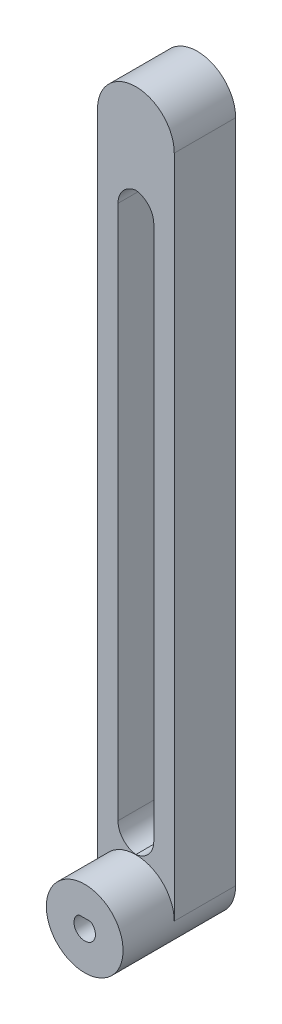
ISO-10303-21;
HEADER;
FILE_DESCRIPTION(('STEP AP214'),'2;1');
FILE_NAME('part.step','',(''),(''),'','','');
FILE_SCHEMA(('AUTOMOTIVE_DESIGN { 1 0 10303 214 1 1 1 1 }'));
ENDSEC;
DATA;
#1=APPLICATION_CONTEXT('core data for automotive mechanical design processes');
#2=APPLICATION_PROTOCOL_DEFINITION('international standard','automotive_design',2000,#1);
#3=PRODUCT_CONTEXT('',#1,'mechanical');
#4=PRODUCT('Part','Part','',(#3));
#5=PRODUCT_RELATED_PRODUCT_CATEGORY('part','',(#4));
#6=PRODUCT_DEFINITION_FORMATION('','',#4);
#7=PRODUCT_DEFINITION_CONTEXT('part definition',#1,'design');
#8=PRODUCT_DEFINITION('design','',#6,#7);
#9=PRODUCT_DEFINITION_SHAPE('','',#8);
#10=(LENGTH_UNIT() NAMED_UNIT(*) SI_UNIT(.MILLI.,.METRE.));
#11=(NAMED_UNIT(*) PLANE_ANGLE_UNIT() SI_UNIT($,.RADIAN.));
#12=(NAMED_UNIT(*) SI_UNIT($,.STERADIAN.) SOLID_ANGLE_UNIT());
#13=UNCERTAINTY_MEASURE_WITH_UNIT(LENGTH_MEASURE(1.E-05),#10,'distance_accuracy_value','');
#14=(GEOMETRIC_REPRESENTATION_CONTEXT(3) GLOBAL_UNCERTAINTY_ASSIGNED_CONTEXT((#13)) GLOBAL_UNIT_ASSIGNED_CONTEXT((#10,
#11,#12)) REPRESENTATION_CONTEXT('',''));
#15=CARTESIAN_POINT('',(0.,0.,0.));
#16=DIRECTION('',(0.,0.,1.));
#17=DIRECTION('',(1.,0.,0.));
#18=AXIS2_PLACEMENT_3D('',#15,#16,#17);
#19=CARTESIAN_POINT('',(1.85483870967741,102.58064516129,12.));
#20=DIRECTION('',(0.,0.,-1.));
#21=DIRECTION('',(-1.,0.,0.));
#22=AXIS2_PLACEMENT_3D('',#19,#20,#21);
#23=PLANE('',#22);
#24=DIRECTION('',(0.,1.,0.));
#25=VECTOR('',#24,1.);
#26=CARTESIAN_POINT('',(5.35483870967741,92.5806451612903,12.));
#27=LINE('',#26,#25);
#28=CARTESIAN_POINT('',(5.35483870967741,-15.9193548387097,12.));
#29=VERTEX_POINT('',#28);
#30=CARTESIAN_POINT('',(5.35483870967741,88.5806451612903,12.));
#31=VERTEX_POINT('',#30);
#32=EDGE_CURVE('E184',#29,#31,#27,.T.);
#33=ORIENTED_EDGE('',*,*,#32,.F.);
#34=CARTESIAN_POINT('',(1.35483870967741,-15.9193548387097,12.));
#35=DIRECTION('',(0.,0.,-1.));
#36=DIRECTION('',(-1.,0.,0.));
#37=AXIS2_PLACEMENT_3D('',#34,#35,#36);
#38=CIRCLE('',#37,4.);
#39=CARTESIAN_POINT('',(1.85483870967744,-19.8879818053066,12.));
#40=VERTEX_POINT('',#39);
#41=EDGE_CURVE('E302',#29,#40,#38,.T.);
#42=ORIENTED_EDGE('',*,*,#41,.T.);
#43=CARTESIAN_POINT('',(2.35483870967741,-15.9193548387097,12.));
#44=DIRECTION('',(0.,0.,-1.));
#45=DIRECTION('',(-1.,0.,0.));
#46=AXIS2_PLACEMENT_3D('',#43,#44,#45);
#47=CIRCLE('',#46,4.);
#48=CARTESIAN_POINT('',(-1.64516129032259,-15.9193548387097,12.));
#49=VERTEX_POINT('',#48);
#50=EDGE_CURVE('E296',#40,#49,#47,.T.);
#51=ORIENTED_EDGE('',*,*,#50,.T.);
#52=DIRECTION('',(0.,-1.,0.));
#53=VECTOR('',#52,1.);
#54=CARTESIAN_POINT('',(-1.64516129032259,92.5806451612903,12.));
#55=LINE('',#54,#53);
#56=CARTESIAN_POINT('',(-1.64516129032259,88.5806451612903,12.));
#57=VERTEX_POINT('',#56);
#58=EDGE_CURVE('E211',#57,#49,#55,.T.);
#59=ORIENTED_EDGE('',*,*,#58,.F.);
#60=CARTESIAN_POINT('',(2.35483870967741,88.5806451612903,12.));
#61=DIRECTION('',(0.,0.,-1.));
#62=DIRECTION('',(-1.,0.,0.));
#63=AXIS2_PLACEMENT_3D('',#60,#61,#62);
#64=CIRCLE('',#63,4.);
#65=CARTESIAN_POINT('',(1.85483870967741,92.5492721278872,12.));
#66=VERTEX_POINT('',#65);
#67=EDGE_CURVE('E57',#57,#66,#64,.T.);
#68=ORIENTED_EDGE('',*,*,#67,.T.);
#69=CARTESIAN_POINT('',(1.35483870967741,88.5806451612903,12.));
#70=DIRECTION('',(0.,0.,-1.));
#71=DIRECTION('',(-1.,0.,0.));
#72=AXIS2_PLACEMENT_3D('',#69,#70,#71);
#73=CIRCLE('',#72,4.);
#74=EDGE_CURVE('E308',#66,#31,#73,.T.);
#75=ORIENTED_EDGE('',*,*,#74,.T.);
#76=EDGE_LOOP('',(#33,#42,#51,#59,#68,#75));
#77=FACE_BOUND('',#76,.T.);
#78=CARTESIAN_POINT('',(1.85483870967743,-27.4193548387097,12.));
#79=DIRECTION('',(0.,0.,1.));
#80=DIRECTION('',(1.,0.,0.));
#81=AXIS2_PLACEMENT_3D('',#78,#79,#80);
#82=CIRCLE('',#81,7.50000000000001);
#83=CARTESIAN_POINT('',(9.35483870967743,-27.4193548387097,12.));
#84=VERTEX_POINT('',#83);
#85=CARTESIAN_POINT('',(-5.64516129032258,-27.4193548387097,12.));
#86=VERTEX_POINT('',#85);
#87=EDGE_CURVE('E153',#84,#86,#82,.T.);
#88=ORIENTED_EDGE('',*,*,#87,.F.);
#89=DIRECTION('',(0.,1.,0.));
#90=VECTOR('',#89,1.);
#91=CARTESIAN_POINT('',(9.35483870967741,102.58064516129,12.));
#92=LINE('',#91,#90);
#93=CARTESIAN_POINT('',(9.35483870967741,102.58064516129,12.));
#94=VERTEX_POINT('',#93);
#95=EDGE_CURVE('E252',#84,#94,#92,.T.);
#96=ORIENTED_EDGE('',*,*,#95,.T.);
#97=CARTESIAN_POINT('',(1.85483870967741,102.58064516129,12.));
#98=DIRECTION('',(0.,0.,1.));
#99=DIRECTION('',(-1.,0.,0.));
#100=AXIS2_PLACEMENT_3D('',#97,#98,#99);
#101=CIRCLE('',#100,7.5);
#102=CARTESIAN_POINT('',(-5.64516129032259,102.58064516129,12.));
#103=VERTEX_POINT('',#102);
#104=EDGE_CURVE('E244',#94,#103,#101,.T.);
#105=ORIENTED_EDGE('',*,*,#104,.T.);
#106=DIRECTION('',(0.,-1.,0.));
#107=VECTOR('',#106,1.);
#108=CARTESIAN_POINT('',(-5.64516129032259,102.58064516129,12.));
#109=LINE('',#108,#107);
#110=EDGE_CURVE('E248',#103,#86,#109,.T.);
#111=ORIENTED_EDGE('',*,*,#110,.T.);
#112=EDGE_LOOP('',(#88,#96,#105,#111));
#113=FACE_BOUND('',#112,.T.);
#114=ADVANCED_FACE('F47',(#77,#113),#23,.F.);
#115=CARTESIAN_POINT('',(1.85483870967741,102.58064516129,12.));
#116=DIRECTION('',(0.,0.,-1.));
#117=DIRECTION('',(-1.,0.,0.));
#118=AXIS2_PLACEMENT_3D('',#115,#116,#117);
#119=CYLINDRICAL_SURFACE('',#118,7.5);
#120=CARTESIAN_POINT('',(1.85483870967741,102.58064516129,0.));
#121=DIRECTION('',(0.,0.,1.));
#122=DIRECTION('',(-1.,0.,0.));
#123=AXIS2_PLACEMENT_3D('',#120,#121,#122);
#124=CIRCLE('',#123,7.5);
#125=CARTESIAN_POINT('',(9.35483870967741,102.58064516129,0.));
#126=VERTEX_POINT('',#125);
#127=CARTESIAN_POINT('',(-5.64516129032259,102.58064516129,0.));
#128=VERTEX_POINT('',#127);
#129=EDGE_CURVE('E243',#126,#128,#124,.T.);
#130=ORIENTED_EDGE('',*,*,#129,.T.);
#131=DIRECTION('',(0.,0.,-1.));
#132=VECTOR('',#131,1.);
#133=CARTESIAN_POINT('',(-5.64516129032259,102.58064516129,12.));
#134=LINE('',#133,#132);
#135=EDGE_CURVE('E278',#103,#128,#134,.T.);
#136=ORIENTED_EDGE('',*,*,#135,.F.);
#137=ORIENTED_EDGE('',*,*,#104,.F.);
#138=DIRECTION('',(0.,0.,-1.));
#139=VECTOR('',#138,1.);
#140=CARTESIAN_POINT('',(9.35483870967741,102.58064516129,12.));
#141=LINE('',#140,#139);
#142=EDGE_CURVE('E255',#94,#126,#141,.T.);
#143=ORIENTED_EDGE('',*,*,#142,.T.);
#144=EDGE_LOOP('',(#130,#136,#137,#143));
#145=FACE_BOUND('',#144,.T.);
#146=ADVANCED_FACE('F352',(#145),#119,.T.);
#147=CARTESIAN_POINT('',(-5.64516129032259,102.58064516129,12.));
#148=DIRECTION('',(1.,0.,0.));
#149=DIRECTION('',(0.,1.,0.));
#150=AXIS2_PLACEMENT_3D('',#147,#148,#149);
#151=PLANE('',#150);
#152=CARTESIAN_POINT('',(-5.64516129032259,78.768969581459,6.));
#153=DIRECTION('',(-1.,0.,0.));
#154=DIRECTION('',(0.,-1.,0.));
#155=AXIS2_PLACEMENT_3D('',#152,#153,#154);
#156=CIRCLE('',#155,5.15);
#157=CARTESIAN_POINT('',(-5.64516129032259,73.618969581459,6.));
#158=VERTEX_POINT('',#157);
#159=EDGE_CURVE('E185',#158,#158,#156,.T.);
#160=ORIENTED_EDGE('',*,*,#159,.F.);
#161=EDGE_LOOP('',(#160));
#162=FACE_BOUND('',#161,.T.);
#163=CARTESIAN_POINT('',(-5.64516129032258,53.768969581459,6.00000000000026));
#164=DIRECTION('',(-1.,0.,0.));
#165=DIRECTION('',(0.,-1.,0.));
#166=AXIS2_PLACEMENT_3D('',#163,#164,#165);
#167=CIRCLE('',#166,5.15);
#168=CARTESIAN_POINT('',(-5.64516129032258,48.618969581459,6.00000000000026));
#169=VERTEX_POINT('',#168);
#170=EDGE_CURVE('E189',#169,#169,#167,.T.);
#171=ORIENTED_EDGE('',*,*,#170,.F.);
#172=EDGE_LOOP('',(#171));
#173=FACE_BOUND('',#172,.T.);
#174=CARTESIAN_POINT('',(-5.64516129032258,28.768969581459,6.00000000000052));
#175=DIRECTION('',(-1.,0.,0.));
#176=DIRECTION('',(0.,-1.,0.));
#177=AXIS2_PLACEMENT_3D('',#174,#175,#176);
#178=CIRCLE('',#177,5.15);
#179=CARTESIAN_POINT('',(-5.64516129032258,23.618969581459,6.00000000000052));
#180=VERTEX_POINT('',#179);
#181=EDGE_CURVE('E197',#180,#180,#178,.T.);
#182=ORIENTED_EDGE('',*,*,#181,.F.);
#183=EDGE_LOOP('',(#182));
#184=FACE_BOUND('',#183,.T.);
#185=DIRECTION('',(0.,-1.,0.));
#186=VECTOR('',#185,1.);
#187=CARTESIAN_POINT('',(-5.64516129032259,102.58064516129,0.));
#188=LINE('',#187,#186);
#189=CARTESIAN_POINT('',(-5.64516129032258,-27.4193548387097,0.));
#190=VERTEX_POINT('',#189);
#191=EDGE_CURVE('E259',#128,#190,#188,.T.);
#192=ORIENTED_EDGE('',*,*,#191,.T.);
#193=DIRECTION('',(0.,0.,-1.));
#194=VECTOR('',#193,1.);
#195=CARTESIAN_POINT('',(-5.64516129032258,-27.4193548387097,12.));
#196=LINE('',#195,#194);
#197=EDGE_CURVE('E274',#86,#190,#196,.T.);
#198=ORIENTED_EDGE('',*,*,#197,.F.);
#199=ORIENTED_EDGE('',*,*,#110,.F.);
#200=ORIENTED_EDGE('',*,*,#135,.T.);
#201=EDGE_LOOP('',(#192,#198,#199,#200));
#202=FACE_BOUND('',#201,.T.);
#203=ADVANCED_FACE('F371',(#162,#173,#184,#202),#151,.F.);
#204=CARTESIAN_POINT('',(1.85483870967743,-27.4193548387097,12.));
#205=DIRECTION('',(0.,0.,-1.));
#206=DIRECTION('',(-1.,0.,0.));
#207=AXIS2_PLACEMENT_3D('',#204,#205,#206);
#208=CYLINDRICAL_SURFACE('',#207,7.5);
#209=CARTESIAN_POINT('',(1.85483870967743,-27.4193548387097,0.));
#210=DIRECTION('',(0.,0.,1.));
#211=DIRECTION('',(1.,0.,0.));
#212=AXIS2_PLACEMENT_3D('',#209,#210,#211);
#213=CIRCLE('',#212,7.5);
#214=CARTESIAN_POINT('',(9.35483870967743,-27.4193548387097,0.));
#215=VERTEX_POINT('',#214);
#216=EDGE_CURVE('E262',#190,#215,#213,.T.);
#217=ORIENTED_EDGE('',*,*,#216,.T.);
#218=DIRECTION('',(0.,0.,-1.));
#219=VECTOR('',#218,1.);
#220=CARTESIAN_POINT('',(9.35483870967743,-27.4193548387097,12.));
#221=LINE('',#220,#219);
#222=EDGE_CURVE('E270',#84,#215,#221,.T.);
#223=ORIENTED_EDGE('',*,*,#222,.F.);
#224=ORIENTED_EDGE('',*,*,#87,.T.);
#225=ORIENTED_EDGE('',*,*,#197,.T.);
#226=EDGE_LOOP('',(#217,#223,#224,#225));
#227=FACE_BOUND('',#226,.T.);
#228=CARTESIAN_POINT('',(1.85483870967743,-27.4193548387097,22.));
#229=DIRECTION('',(0.,0.,1.));
#230=DIRECTION('',(-1.,0.,0.));
#231=AXIS2_PLACEMENT_3D('',#228,#229,#230);
#232=CIRCLE('',#231,7.50000000000001);
#233=CARTESIAN_POINT('',(-5.64516129032258,-27.4193548387097,22.));
#234=VERTEX_POINT('',#233);
#235=EDGE_CURVE('E173',#234,#234,#232,.T.);
#236=ORIENTED_EDGE('',*,*,#235,.F.);
#237=EDGE_LOOP('',(#236));
#238=FACE_BOUND('',#237,.T.);
#239=ADVANCED_FACE('F359',(#227,#238),#208,.T.);
#240=CARTESIAN_POINT('',(9.35483870967741,102.58064516129,12.));
#241=DIRECTION('',(-1.,0.,0.));
#242=DIRECTION('',(0.,-1.,0.));
#243=AXIS2_PLACEMENT_3D('',#240,#241,#242);
#244=PLANE('',#243);
#245=DIRECTION('',(0.,1.,0.));
#246=VECTOR('',#245,1.);
#247=CARTESIAN_POINT('',(9.35483870967741,102.58064516129,0.));
#248=LINE('',#247,#246);
#249=EDGE_CURVE('E249',#215,#126,#248,.T.);
#250=ORIENTED_EDGE('',*,*,#249,.T.);
#251=ORIENTED_EDGE('',*,*,#142,.F.);
#252=ORIENTED_EDGE('',*,*,#95,.F.);
#253=ORIENTED_EDGE('',*,*,#222,.T.);
#254=EDGE_LOOP('',(#250,#251,#252,#253));
#255=FACE_BOUND('',#254,.T.);
#256=ADVANCED_FACE('F364',(#255),#244,.F.);
#257=CARTESIAN_POINT('',(1.85483870967741,102.58064516129,0.));
#258=DIRECTION('',(0.,0.,-1.));
#259=DIRECTION('',(-1.,0.,0.));
#260=AXIS2_PLACEMENT_3D('',#257,#258,#259);
#261=PLANE('',#260);
#262=CARTESIAN_POINT('',(2.35483870967741,-15.9193548387097,0.));
#263=DIRECTION('',(0.,0.,-1.));
#264=DIRECTION('',(-1.,0.,0.));
#265=AXIS2_PLACEMENT_3D('',#262,#263,#264);
#266=CIRCLE('',#265,4.);
#267=CARTESIAN_POINT('',(-1.64516129032259,-15.9193548387097,0.));
#268=VERTEX_POINT('',#267);
#269=CARTESIAN_POINT('',(1.85483870967744,-19.8879818053066,0.));
#270=VERTEX_POINT('',#269);
#271=EDGE_CURVE('E299',#268,#270,#266,.F.);
#272=ORIENTED_EDGE('',*,*,#271,.T.);
#273=CARTESIAN_POINT('',(1.35483870967741,-15.9193548387097,0.));
#274=DIRECTION('',(0.,0.,-1.));
#275=DIRECTION('',(-1.,0.,0.));
#276=AXIS2_PLACEMENT_3D('',#273,#274,#275);
#277=CIRCLE('',#276,4.);
#278=CARTESIAN_POINT('',(5.35483870967741,-15.9193548387097,0.));
#279=VERTEX_POINT('',#278);
#280=EDGE_CURVE('E305',#270,#279,#277,.F.);
#281=ORIENTED_EDGE('',*,*,#280,.T.);
#282=DIRECTION('',(0.,1.,0.));
#283=VECTOR('',#282,1.);
#284=CARTESIAN_POINT('',(5.35483870967741,92.5806451612903,0.));
#285=LINE('',#284,#283);
#286=CARTESIAN_POINT('',(5.35483870967741,88.5806451612903,0.));
#287=VERTEX_POINT('',#286);
#288=EDGE_CURVE('E206',#279,#287,#285,.T.);
#289=ORIENTED_EDGE('',*,*,#288,.T.);
#290=CARTESIAN_POINT('',(1.35483870967741,88.5806451612903,0.));
#291=DIRECTION('',(0.,0.,-1.));
#292=DIRECTION('',(-1.,0.,0.));
#293=AXIS2_PLACEMENT_3D('',#290,#291,#292);
#294=CIRCLE('',#293,4.);
#295=CARTESIAN_POINT('',(1.85483870967741,92.5492721278872,0.));
#296=VERTEX_POINT('',#295);
#297=EDGE_CURVE('E311',#287,#296,#294,.F.);
#298=ORIENTED_EDGE('',*,*,#297,.T.);
#299=CARTESIAN_POINT('',(2.35483870967741,88.5806451612903,0.));
#300=DIRECTION('',(0.,0.,-1.));
#301=DIRECTION('',(-1.,0.,0.));
#302=AXIS2_PLACEMENT_3D('',#299,#300,#301);
#303=CIRCLE('',#302,4.);
#304=CARTESIAN_POINT('',(-1.64516129032259,88.5806451612903,0.));
#305=VERTEX_POINT('',#304);
#306=EDGE_CURVE('E11',#296,#305,#303,.F.);
#307=ORIENTED_EDGE('',*,*,#306,.T.);
#308=DIRECTION('',(0.,-1.,0.));
#309=VECTOR('',#308,1.);
#310=CARTESIAN_POINT('',(-1.64516129032259,92.5806451612903,0.));
#311=LINE('',#310,#309);
#312=EDGE_CURVE('E210',#305,#268,#311,.T.);
#313=ORIENTED_EDGE('',*,*,#312,.T.);
#314=EDGE_LOOP('',(#272,#281,#289,#298,#307,#313));
#315=FACE_BOUND('',#314,.T.);
#316=CARTESIAN_POINT('',(1.85483870967743,-27.4193548387097,0.));
#317=DIRECTION('',(0.,0.,-1.));
#318=DIRECTION('',(-1.,0.,0.));
#319=AXIS2_PLACEMENT_3D('',#316,#317,#318);
#320=CIRCLE('',#319,3.1);
#321=CARTESIAN_POINT('',(3.54303301129084,-24.8193548387097,0.));
#322=VERTEX_POINT('',#321);
#323=CARTESIAN_POINT('',(0.166644408064011,-24.8193548387097,0.));
#324=VERTEX_POINT('',#323);
#325=EDGE_CURVE('E235',#322,#324,#320,.T.);
#326=ORIENTED_EDGE('',*,*,#325,.F.);
#327=DIRECTION('',(1.,0.,0.));
#328=VECTOR('',#327,1.);
#329=CARTESIAN_POINT('',(1.85483870967741,-24.8193548387097,0.));
#330=LINE('',#329,#328);
#331=EDGE_CURVE('E230',#324,#322,#330,.T.);
#332=ORIENTED_EDGE('',*,*,#331,.F.);
#333=EDGE_LOOP('',(#326,#332));
#334=FACE_BOUND('',#333,.T.);
#335=ORIENTED_EDGE('',*,*,#129,.F.);
#336=ORIENTED_EDGE('',*,*,#249,.F.);
#337=ORIENTED_EDGE('',*,*,#216,.F.);
#338=ORIENTED_EDGE('',*,*,#191,.F.);
#339=EDGE_LOOP('',(#335,#336,#337,#338));
#340=FACE_BOUND('',#339,.T.);
#341=ADVANCED_FACE('F333',(#315,#334,#340),#261,.T.);
#342=CARTESIAN_POINT('',(1.85483870967743,-27.4193548387097,-23.));
#343=DIRECTION('',(0.,0.,1.));
#344=DIRECTION('',(1.,0.,0.));
#345=AXIS2_PLACEMENT_3D('',#342,#343,#344);
#346=CYLINDRICAL_SURFACE('',#345,3.1);
#347=DIRECTION('',(0.,0.,1.));
#348=VECTOR('',#347,1.);
#349=CARTESIAN_POINT('',(3.54303301129084,-24.8193548387097,-23.));
#350=LINE('',#349,#348);
#351=CARTESIAN_POINT('',(3.54303301129084,-24.8193548387097,12.));
#352=VERTEX_POINT('',#351);
#353=EDGE_CURVE('E225',#322,#352,#350,.T.);
#354=ORIENTED_EDGE('',*,*,#353,.F.);
#355=ORIENTED_EDGE('',*,*,#325,.T.);
#356=DIRECTION('',(0.,0.,1.));
#357=VECTOR('',#356,1.);
#358=CARTESIAN_POINT('',(0.166644408064011,-24.8193548387097,-23.));
#359=LINE('',#358,#357);
#360=CARTESIAN_POINT('',(0.166644408064011,-24.8193548387097,12.));
#361=VERTEX_POINT('',#360);
#362=EDGE_CURVE('E226',#324,#361,#359,.T.);
#363=ORIENTED_EDGE('',*,*,#362,.T.);
#364=CARTESIAN_POINT('',(1.85483870967743,-27.4193548387097,12.));
#365=DIRECTION('',(0.,0.,-1.));
#366=DIRECTION('',(-1.,0.,0.));
#367=AXIS2_PLACEMENT_3D('',#364,#365,#366);
#368=CIRCLE('',#367,3.1);
#369=EDGE_CURVE('E239',#352,#361,#368,.T.);
#370=ORIENTED_EDGE('',*,*,#369,.F.);
#371=EDGE_LOOP('',(#354,#355,#363,#370));
#372=FACE_BOUND('',#371,.T.);
#373=ADVANCED_FACE('F436',(#372),#346,.F.);
#374=CARTESIAN_POINT('',(0.166644408064011,-24.8193548387097,-23.));
#375=DIRECTION('',(0.,1.,0.));
#376=DIRECTION('',(0.,0.,1.));
#377=AXIS2_PLACEMENT_3D('',#374,#375,#376);
#378=PLANE('',#377);
#379=ORIENTED_EDGE('',*,*,#353,.T.);
#380=DIRECTION('',(1.,0.,0.));
#381=VECTOR('',#380,1.);
#382=CARTESIAN_POINT('',(0.166644408064011,-24.8193548387097,12.));
#383=LINE('',#382,#381);
#384=EDGE_CURVE('E215',#361,#352,#383,.T.);
#385=ORIENTED_EDGE('',*,*,#384,.F.);
#386=ORIENTED_EDGE('',*,*,#362,.F.);
#387=ORIENTED_EDGE('',*,*,#331,.T.);
#388=EDGE_LOOP('',(#379,#385,#386,#387));
#389=FACE_BOUND('',#388,.T.);
#390=ADVANCED_FACE('F427',(#389),#378,.F.);
#391=CARTESIAN_POINT('',(-1.64516129032259,92.5806451612903,0.));
#392=DIRECTION('',(-1.,0.,0.));
#393=DIRECTION('',(0.,-1.,0.));
#394=AXIS2_PLACEMENT_3D('',#391,#392,#393);
#395=PLANE('',#394);
#396=ORIENTED_EDGE('',*,*,#58,.T.);
#397=DIRECTION('',(0.,0.,1.));
#398=VECTOR('',#397,1.);
#399=CARTESIAN_POINT('',(-1.64516129032259,-15.9193548387097,0.));
#400=LINE('',#399,#398);
#401=EDGE_CURVE('E285',#49,#268,#400,.F.);
#402=ORIENTED_EDGE('',*,*,#401,.T.);
#403=ORIENTED_EDGE('',*,*,#312,.F.);
#404=DIRECTION('',(0.,0.,1.));
#405=VECTOR('',#404,1.);
#406=CARTESIAN_POINT('',(-1.64516129032259,88.5806451612903,12.));
#407=LINE('',#406,#405);
#408=EDGE_CURVE('E282',#305,#57,#407,.T.);
#409=ORIENTED_EDGE('',*,*,#408,.T.);
#410=EDGE_LOOP('',(#396,#402,#403,#409));
#411=FACE_BOUND('',#410,.T.);
#412=ADVANCED_FACE('F336',(#411),#395,.F.);
#413=CARTESIAN_POINT('',(5.35483870967741,92.5806451612903,0.));
#414=DIRECTION('',(1.,0.,0.));
#415=DIRECTION('',(0.,0.,-1.));
#416=AXIS2_PLACEMENT_3D('',#413,#414,#415);
#417=PLANE('',#416);
#418=ORIENTED_EDGE('',*,*,#288,.F.);
#419=DIRECTION('',(0.,0.,1.));
#420=VECTOR('',#419,1.);
#421=CARTESIAN_POINT('',(5.35483870967741,-15.9193548387097,12.));
#422=LINE('',#421,#420);
#423=EDGE_CURVE('E293',#279,#29,#422,.T.);
#424=ORIENTED_EDGE('',*,*,#423,.T.);
#425=ORIENTED_EDGE('',*,*,#32,.T.);
#426=DIRECTION('',(0.,0.,1.));
#427=VECTOR('',#426,1.);
#428=CARTESIAN_POINT('',(5.35483870967741,88.5806451612903,0.));
#429=LINE('',#428,#427);
#430=EDGE_CURVE('E289',#31,#287,#429,.F.);
#431=ORIENTED_EDGE('',*,*,#430,.T.);
#432=EDGE_LOOP('',(#418,#424,#425,#431));
#433=FACE_BOUND('',#432,.T.);
#434=ADVANCED_FACE('F348',(#433),#417,.F.);
#435=CARTESIAN_POINT('',(-3.64516129032258,28.768969581459,6.00000000000052));
#436=DIRECTION('',(-1.,0.,0.));
#437=DIRECTION('',(0.,-1.,0.));
#438=AXIS2_PLACEMENT_3D('',#435,#436,#437);
#439=CYLINDRICAL_SURFACE('',#438,5.15);
#440=CARTESIAN_POINT('',(-3.64516129032258,28.768969581459,6.00000000000052));
#441=DIRECTION('',(-1.,0.,0.));
#442=DIRECTION('',(0.,-1.,0.));
#443=AXIS2_PLACEMENT_3D('',#440,#441,#442);
#444=CIRCLE('',#443,5.15);
#445=CARTESIAN_POINT('',(-3.64516129032258,23.618969581459,6.00000000000052));
#446=VERTEX_POINT('',#445);
#447=EDGE_CURVE('E201',#446,#446,#444,.T.);
#448=ORIENTED_EDGE('',*,*,#447,.F.);
#449=EDGE_LOOP('',(#448));
#450=FACE_BOUND('',#449,.T.);
#451=ORIENTED_EDGE('',*,*,#181,.T.);
#452=EDGE_LOOP('',(#451));
#453=FACE_BOUND('',#452,.T.);
#454=ADVANCED_FACE('F418',(#450,#453),#439,.F.);
#455=CARTESIAN_POINT('',(-3.64516129032258,28.768969581459,6.00000000000052));
#456=DIRECTION('',(-1.,0.,0.));
#457=DIRECTION('',(0.,-1.,0.));
#458=AXIS2_PLACEMENT_3D('',#455,#456,#457);
#459=PLANE('',#458);
#460=ORIENTED_EDGE('',*,*,#447,.T.);
#461=EDGE_LOOP('',(#460));
#462=FACE_BOUND('',#461,.T.);
#463=ADVANCED_FACE('F472',(#462),#459,.T.);
#464=CARTESIAN_POINT('',(-3.64516129032258,53.768969581459,6.00000000000026));
#465=DIRECTION('',(-1.,0.,0.));
#466=DIRECTION('',(0.,-1.,0.));
#467=AXIS2_PLACEMENT_3D('',#464,#465,#466);
#468=CYLINDRICAL_SURFACE('',#467,5.15);
#469=CARTESIAN_POINT('',(-3.64516129032258,53.768969581459,6.00000000000026));
#470=DIRECTION('',(-1.,0.,0.));
#471=DIRECTION('',(0.,-1.,0.));
#472=AXIS2_PLACEMENT_3D('',#469,#470,#471);
#473=CIRCLE('',#472,5.15);
#474=CARTESIAN_POINT('',(-3.64516129032258,48.618969581459,6.00000000000026));
#475=VERTEX_POINT('',#474);
#476=EDGE_CURVE('E193',#475,#475,#473,.T.);
#477=ORIENTED_EDGE('',*,*,#476,.F.);
#478=EDGE_LOOP('',(#477));
#479=FACE_BOUND('',#478,.T.);
#480=ORIENTED_EDGE('',*,*,#170,.T.);
#481=EDGE_LOOP('',(#480));
#482=FACE_BOUND('',#481,.T.);
#483=ADVANCED_FACE('F463',(#479,#482),#468,.F.);
#484=CARTESIAN_POINT('',(-3.64516129032258,53.768969581459,6.00000000000026));
#485=DIRECTION('',(-1.,0.,0.));
#486=DIRECTION('',(0.,-1.,0.));
#487=AXIS2_PLACEMENT_3D('',#484,#485,#486);
#488=PLANE('',#487);
#489=ORIENTED_EDGE('',*,*,#476,.T.);
#490=EDGE_LOOP('',(#489));
#491=FACE_BOUND('',#490,.T.);
#492=ADVANCED_FACE('F454',(#491),#488,.T.);
#493=CARTESIAN_POINT('',(-3.64516129032259,78.768969581459,6.));
#494=DIRECTION('',(-1.,0.,0.));
#495=DIRECTION('',(0.,-1.,0.));
#496=AXIS2_PLACEMENT_3D('',#493,#494,#495);
#497=CYLINDRICAL_SURFACE('',#496,5.15);
#498=CARTESIAN_POINT('',(-3.64516129032259,78.768969581459,6.));
#499=DIRECTION('',(-1.,0.,0.));
#500=DIRECTION('',(0.,-1.,0.));
#501=AXIS2_PLACEMENT_3D('',#498,#499,#500);
#502=CIRCLE('',#501,5.15);
#503=CARTESIAN_POINT('',(-3.64516129032259,73.618969581459,6.));
#504=VERTEX_POINT('',#503);
#505=EDGE_CURVE('E180',#504,#504,#502,.T.);
#506=ORIENTED_EDGE('',*,*,#505,.F.);
#507=EDGE_LOOP('',(#506));
#508=FACE_BOUND('',#507,.T.);
#509=ORIENTED_EDGE('',*,*,#159,.T.);
#510=EDGE_LOOP('',(#509));
#511=FACE_BOUND('',#510,.T.);
#512=ADVANCED_FACE('F445',(#508,#511),#497,.F.);
#513=CARTESIAN_POINT('',(-3.64516129032259,78.768969581459,6.));
#514=DIRECTION('',(-1.,0.,0.));
#515=DIRECTION('',(0.,-1.,0.));
#516=AXIS2_PLACEMENT_3D('',#513,#514,#515);
#517=PLANE('',#516);
#518=ORIENTED_EDGE('',*,*,#505,.T.);
#519=EDGE_LOOP('',(#518));
#520=FACE_BOUND('',#519,.T.);
#521=ADVANCED_FACE('F388',(#520),#517,.T.);
#522=CARTESIAN_POINT('',(1.35483870967741,-15.9193548387097,0.));
#523=DIRECTION('',(0.,0.,-1.));
#524=DIRECTION('',(-1.,0.,0.));
#525=AXIS2_PLACEMENT_3D('',#522,#523,#524);
#526=CYLINDRICAL_SURFACE('',#525,4.);
#527=ORIENTED_EDGE('',*,*,#423,.F.);
#528=ORIENTED_EDGE('',*,*,#280,.F.);
#529=DIRECTION('',(0.,0.,-1.));
#530=VECTOR('',#529,1.);
#531=CARTESIAN_POINT('',(1.85483870967744,-19.8879818053066,6.));
#532=LINE('',#531,#530);
#533=EDGE_CURVE('E205',#40,#270,#532,.T.);
#534=ORIENTED_EDGE('',*,*,#533,.F.);
#535=ORIENTED_EDGE('',*,*,#41,.F.);
#536=EDGE_LOOP('',(#527,#528,#534,#535));
#537=FACE_BOUND('',#536,.T.);
#538=ADVANCED_FACE('F344',(#537),#526,.F.);
#539=CARTESIAN_POINT('',(2.35483870967741,-15.9193548387097,0.));
#540=DIRECTION('',(0.,0.,-1.));
#541=DIRECTION('',(-1.,0.,0.));
#542=AXIS2_PLACEMENT_3D('',#539,#540,#541);
#543=CYLINDRICAL_SURFACE('',#542,4.);
#544=ORIENTED_EDGE('',*,*,#271,.F.);
#545=ORIENTED_EDGE('',*,*,#401,.F.);
#546=ORIENTED_EDGE('',*,*,#50,.F.);
#547=ORIENTED_EDGE('',*,*,#533,.T.);
#548=EDGE_LOOP('',(#544,#545,#546,#547));
#549=FACE_BOUND('',#548,.T.);
#550=ADVANCED_FACE('F339',(#549),#543,.F.);
#551=CARTESIAN_POINT('',(2.35483870967741,88.5806451612903,0.));
#552=DIRECTION('',(0.,0.,-1.));
#553=DIRECTION('',(-1.,0.,0.));
#554=AXIS2_PLACEMENT_3D('',#551,#552,#553);
#555=CYLINDRICAL_SURFACE('',#554,4.);
#556=ORIENTED_EDGE('',*,*,#408,.F.);
#557=ORIENTED_EDGE('',*,*,#306,.F.);
#558=DIRECTION('',(0.,0.,-1.));
#559=VECTOR('',#558,1.);
#560=CARTESIAN_POINT('',(1.85483870967741,92.5492721278872,6.));
#561=LINE('',#560,#559);
#562=EDGE_CURVE('E51',#66,#296,#561,.T.);
#563=ORIENTED_EDGE('',*,*,#562,.F.);
#564=ORIENTED_EDGE('',*,*,#67,.F.);
#565=EDGE_LOOP('',(#556,#557,#563,#564));
#566=FACE_BOUND('',#565,.T.);
#567=ADVANCED_FACE('F49',(#566),#555,.F.);
#568=CARTESIAN_POINT('',(1.35483870967741,88.5806451612903,0.));
#569=DIRECTION('',(0.,0.,-1.));
#570=DIRECTION('',(-1.,0.,0.));
#571=AXIS2_PLACEMENT_3D('',#568,#569,#570);
#572=CYLINDRICAL_SURFACE('',#571,4.);
#573=ORIENTED_EDGE('',*,*,#297,.F.);
#574=ORIENTED_EDGE('',*,*,#430,.F.);
#575=ORIENTED_EDGE('',*,*,#74,.F.);
#576=ORIENTED_EDGE('',*,*,#562,.T.);
#577=EDGE_LOOP('',(#573,#574,#575,#576));
#578=FACE_BOUND('',#577,.T.);
#579=ADVANCED_FACE('F325',(#578),#572,.F.);
#580=CARTESIAN_POINT('',(1.85483870967743,-27.4193548387097,22.));
#581=DIRECTION('',(0.,0.,-1.));
#582=DIRECTION('',(-1.,0.,0.));
#583=AXIS2_PLACEMENT_3D('',#580,#581,#582);
#584=PLANE('',#583);
#585=CARTESIAN_POINT('',(1.85483870967743,-27.4193548387097,22.));
#586=DIRECTION('',(0.,0.,1.));
#587=DIRECTION('',(1.,0.,0.));
#588=AXIS2_PLACEMENT_3D('',#585,#586,#587);
#589=CIRCLE('',#588,2.1);
#590=CARTESIAN_POINT('',(0.694020033053039,-25.6693548387097,22.));
#591=VERTEX_POINT('',#590);
#592=CARTESIAN_POINT('',(3.01565738630182,-25.6693548387097,22.));
#593=VERTEX_POINT('',#592);
#594=EDGE_CURVE('E69',#591,#593,#589,.T.);
#595=ORIENTED_EDGE('',*,*,#594,.F.);
#596=DIRECTION('',(1.,0.,0.));
#597=VECTOR('',#596,1.);
#598=CARTESIAN_POINT('',(0.694020033053039,-25.6693548387097,22.));
#599=LINE('',#598,#597);
#600=EDGE_CURVE('E164',#591,#593,#599,.T.);
#601=ORIENTED_EDGE('',*,*,#600,.T.);
#602=EDGE_LOOP('',(#595,#601));
#603=FACE_BOUND('',#602,.T.);
#604=ORIENTED_EDGE('',*,*,#235,.T.);
#605=EDGE_LOOP('',(#604));
#606=FACE_BOUND('',#605,.T.);
#607=ADVANCED_FACE('F390',(#603,#606),#584,.F.);
#608=CARTESIAN_POINT('',(1.85483870967743,-27.4193548387097,12.));
#609=DIRECTION('',(0.,0.,-1.));
#610=DIRECTION('',(-1.,0.,0.));
#611=AXIS2_PLACEMENT_3D('',#608,#609,#610);
#612=PLANE('',#611);
#613=ORIENTED_EDGE('',*,*,#384,.T.);
#614=ORIENTED_EDGE('',*,*,#369,.T.);
#615=EDGE_LOOP('',(#613,#614));
#616=FACE_BOUND('',#615,.T.);
#617=ADVANCED_FACE('F395',(#616),#612,.T.);
#618=CARTESIAN_POINT('',(1.85483870967743,-27.4193548387097,15.));
#619=DIRECTION('',(0.,0.,1.));
#620=DIRECTION('',(1.,0.,0.));
#621=AXIS2_PLACEMENT_3D('',#618,#619,#620);
#622=CYLINDRICAL_SURFACE('',#621,2.1);
#623=ORIENTED_EDGE('',*,*,#594,.T.);
#624=DIRECTION('',(0.,0.,1.));
#625=VECTOR('',#624,1.);
#626=CARTESIAN_POINT('',(3.01565738630182,-25.6693548387097,15.));
#627=LINE('',#626,#625);
#628=CARTESIAN_POINT('',(3.01565738630182,-25.6693548387097,15.));
#629=VERTEX_POINT('',#628);
#630=EDGE_CURVE('E155',#629,#593,#627,.T.);
#631=ORIENTED_EDGE('',*,*,#630,.F.);
#632=CARTESIAN_POINT('',(1.85483870967743,-27.4193548387097,15.));
#633=DIRECTION('',(0.,0.,1.));
#634=DIRECTION('',(1.,0.,0.));
#635=AXIS2_PLACEMENT_3D('',#632,#633,#634);
#636=CIRCLE('',#635,2.1);
#637=CARTESIAN_POINT('',(0.694020033053039,-25.6693548387097,15.));
#638=VERTEX_POINT('',#637);
#639=EDGE_CURVE('E148',#638,#629,#636,.T.);
#640=ORIENTED_EDGE('',*,*,#639,.F.);
#641=DIRECTION('',(0.,0.,1.));
#642=VECTOR('',#641,1.);
#643=CARTESIAN_POINT('',(0.694020033053039,-25.6693548387097,15.));
#644=LINE('',#643,#642);
#645=EDGE_CURVE('E65',#638,#591,#644,.T.);
#646=ORIENTED_EDGE('',*,*,#645,.T.);
#647=EDGE_LOOP('',(#623,#631,#640,#646));
#648=FACE_BOUND('',#647,.T.);
#649=ADVANCED_FACE('F156',(#648),#622,.F.);
#650=CARTESIAN_POINT('',(1.85483870967743,-27.4193548387097,15.));
#651=DIRECTION('',(0.,0.,1.));
#652=DIRECTION('',(1.,0.,0.));
#653=AXIS2_PLACEMENT_3D('',#650,#651,#652);
#654=PLANE('',#653);
#655=DIRECTION('',(1.,0.,0.));
#656=VECTOR('',#655,1.);
#657=CARTESIAN_POINT('',(0.694020033053039,-25.6693548387097,15.));
#658=LINE('',#657,#656);
#659=EDGE_CURVE('E151',#638,#629,#658,.T.);
#660=ORIENTED_EDGE('',*,*,#659,.F.);
#661=ORIENTED_EDGE('',*,*,#639,.T.);
#662=EDGE_LOOP('',(#660,#661));
#663=FACE_BOUND('',#662,.T.);
#664=ADVANCED_FACE('F149',(#663),#654,.T.);
#665=CARTESIAN_POINT('',(0.694020033053039,-25.6693548387097,15.));
#666=DIRECTION('',(0.,-1.,0.));
#667=DIRECTION('',(0.,0.,-1.));
#668=AXIS2_PLACEMENT_3D('',#665,#666,#667);
#669=PLANE('',#668);
#670=ORIENTED_EDGE('',*,*,#600,.F.);
#671=ORIENTED_EDGE('',*,*,#645,.F.);
#672=ORIENTED_EDGE('',*,*,#659,.T.);
#673=ORIENTED_EDGE('',*,*,#630,.T.);
#674=EDGE_LOOP('',(#670,#671,#672,#673));
#675=FACE_BOUND('',#674,.T.);
#676=ADVANCED_FACE('F162',(#675),#669,.T.);
#677=CLOSED_SHELL('',(#114,#146,#203,#239,#256,#341,#373,#390,#412,#434,#454,#463,#483,#492,
#512,#521,#538,#550,#567,#579,#607,#617,#649,#664,#676));
#678=MANIFOLD_SOLID_BREP('B2',#677);
#679=ADVANCED_BREP_SHAPE_REPRESENTATION('',(#18,#678),#14);
#680=SHAPE_DEFINITION_REPRESENTATION(#9,#679);
ENDSEC;
END-ISO-10303-21;
